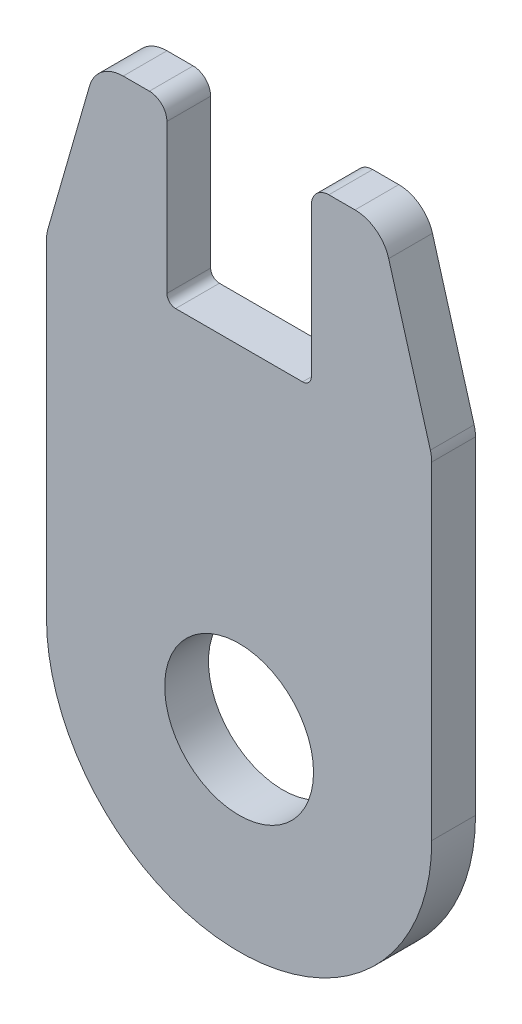
ISO-10303-21;
HEADER;
FILE_DESCRIPTION(('STEP AP214'),'2;1');
FILE_NAME('part.step','',(''),(''),'','','');
FILE_SCHEMA(('AUTOMOTIVE_DESIGN { 1 0 10303 214 1 1 1 1 }'));
ENDSEC;
DATA;
#1=APPLICATION_CONTEXT('core data for automotive mechanical design processes');
#2=APPLICATION_PROTOCOL_DEFINITION('international standard','automotive_design',2000,#1);
#3=PRODUCT_CONTEXT('',#1,'mechanical');
#4=PRODUCT('Part','Part','',(#3));
#5=PRODUCT_RELATED_PRODUCT_CATEGORY('part','',(#4));
#6=PRODUCT_DEFINITION_FORMATION('','',#4);
#7=PRODUCT_DEFINITION_CONTEXT('part definition',#1,'design');
#8=PRODUCT_DEFINITION('design','',#6,#7);
#9=PRODUCT_DEFINITION_SHAPE('','',#8);
#10=(LENGTH_UNIT() NAMED_UNIT(*) SI_UNIT(.MILLI.,.METRE.));
#11=(NAMED_UNIT(*) PLANE_ANGLE_UNIT() SI_UNIT($,.RADIAN.));
#12=(NAMED_UNIT(*) SI_UNIT($,.STERADIAN.) SOLID_ANGLE_UNIT());
#13=UNCERTAINTY_MEASURE_WITH_UNIT(LENGTH_MEASURE(1.E-05),#10,'distance_accuracy_value','');
#14=(GEOMETRIC_REPRESENTATION_CONTEXT(3) GLOBAL_UNCERTAINTY_ASSIGNED_CONTEXT((#13)) GLOBAL_UNIT_ASSIGNED_CONTEXT((#10,
#11,#12)) REPRESENTATION_CONTEXT('',''));
#15=CARTESIAN_POINT('',(0.,0.,0.));
#16=DIRECTION('',(0.,0.,1.));
#17=DIRECTION('',(1.,0.,0.));
#18=AXIS2_PLACEMENT_3D('',#15,#16,#17);
#19=CARTESIAN_POINT('',(0.,0.,1.25));
#20=DIRECTION('',(0.,0.,-1.));
#21=DIRECTION('',(-1.,0.,0.));
#22=AXIS2_PLACEMENT_3D('',#19,#20,#21);
#23=PLANE('',#22);
#24=CARTESIAN_POINT('',(0.,0.,1.25));
#25=DIRECTION('',(0.,0.,1.));
#26=DIRECTION('',(-1.,0.,0.));
#27=AXIS2_PLACEMENT_3D('',#24,#25,#26);
#28=CIRCLE('',#27,11.);
#29=CARTESIAN_POINT('',(-11.,0.,1.25));
#30=VERTEX_POINT('',#29);
#31=CARTESIAN_POINT('',(11.,0.,1.25));
#32=VERTEX_POINT('',#31);
#33=EDGE_CURVE('E224',#30,#32,#28,.T.);
#34=ORIENTED_EDGE('',*,*,#33,.T.);
#35=DIRECTION('',(0.,1.,0.));
#36=VECTOR('',#35,1.);
#37=CARTESIAN_POINT('',(11.,0.,1.25));
#38=LINE('',#37,#36);
#39=CARTESIAN_POINT('',(11.,18.7182073837716,1.25));
#40=VERTEX_POINT('',#39);
#41=EDGE_CURVE('E122',#32,#40,#38,.T.);
#42=ORIENTED_EDGE('',*,*,#41,.T.);
#43=CARTESIAN_POINT('',(9.,18.7182073837716,1.25));
#44=DIRECTION('',(0.,0.,1.));
#45=DIRECTION('',(-1.,0.,0.));
#46=AXIS2_PLACEMENT_3D('',#43,#44,#45);
#47=CIRCLE('',#46,2.);
#48=CARTESIAN_POINT('',(10.9221386078598,19.2708222335312,1.25));
#49=VERTEX_POINT('',#48);
#50=EDGE_CURVE('E269',#40,#49,#47,.T.);
#51=ORIENTED_EDGE('',*,*,#50,.T.);
#52=DIRECTION('',(-0.276307424879841,0.961069303929884,0.));
#53=VECTOR('',#52,1.);
#54=CARTESIAN_POINT('',(8.5411232306941,27.5526148497597,1.25));
#55=LINE('',#54,#53);
#56=CARTESIAN_POINT('',(8.5411232306941,27.5526148497597,1.25));
#57=VERTEX_POINT('',#56);
#58=EDGE_CURVE('E288',#49,#57,#55,.T.);
#59=ORIENTED_EDGE('',*,*,#58,.T.);
#60=CARTESIAN_POINT('',(6.61898462283433,27.,1.25));
#61=DIRECTION('',(0.,0.,1.));
#62=DIRECTION('',(1.,0.,0.));
#63=AXIS2_PLACEMENT_3D('',#60,#61,#62);
#64=CIRCLE('',#63,2.);
#65=CARTESIAN_POINT('',(6.61898462283433,29.,1.25));
#66=VERTEX_POINT('',#65);
#67=EDGE_CURVE('E285',#57,#66,#64,.T.);
#68=ORIENTED_EDGE('',*,*,#67,.T.);
#69=DIRECTION('',(-1.,0.,0.));
#70=VECTOR('',#69,1.);
#71=CARTESIAN_POINT('',(6.61898462283433,29.,1.25));
#72=LINE('',#71,#70);
#73=CARTESIAN_POINT('',(5.125,29.,1.25));
#74=VERTEX_POINT('',#73);
#75=EDGE_CURVE('E287',#66,#74,#72,.T.);
#76=ORIENTED_EDGE('',*,*,#75,.T.);
#77=CARTESIAN_POINT('',(5.125,28.,1.25));
#78=DIRECTION('',(0.,0.,1.));
#79=DIRECTION('',(1.,0.,0.));
#80=AXIS2_PLACEMENT_3D('',#77,#78,#79);
#81=CIRCLE('',#80,1.);
#82=CARTESIAN_POINT('',(4.125,28.,1.25));
#83=VERTEX_POINT('',#82);
#84=EDGE_CURVE('E290',#74,#83,#81,.T.);
#85=ORIENTED_EDGE('',*,*,#84,.T.);
#86=DIRECTION('',(0.,-1.,0.));
#87=VECTOR('',#86,1.);
#88=CARTESIAN_POINT('',(4.125,28.,1.25));
#89=LINE('',#88,#87);
#90=CARTESIAN_POINT('',(4.125,19.5,1.25));
#91=VERTEX_POINT('',#90);
#92=EDGE_CURVE('E296',#83,#91,#89,.T.);
#93=ORIENTED_EDGE('',*,*,#92,.T.);
#94=CARTESIAN_POINT('',(3.625,19.5,1.25));
#95=DIRECTION('',(0.,0.,-1.));
#96=DIRECTION('',(-1.,0.,0.));
#97=AXIS2_PLACEMENT_3D('',#94,#95,#96);
#98=CIRCLE('',#97,0.499999999999999);
#99=CARTESIAN_POINT('',(3.625,19.,1.25));
#100=VERTEX_POINT('',#99);
#101=EDGE_CURVE('E298',#91,#100,#98,.T.);
#102=ORIENTED_EDGE('',*,*,#101,.T.);
#103=DIRECTION('',(-1.,0.,0.));
#104=VECTOR('',#103,1.);
#105=CARTESIAN_POINT('',(3.625,19.,1.25));
#106=LINE('',#105,#104);
#107=CARTESIAN_POINT('',(-3.625,19.,1.25));
#108=VERTEX_POINT('',#107);
#109=EDGE_CURVE('E300',#100,#108,#106,.T.);
#110=ORIENTED_EDGE('',*,*,#109,.T.);
#111=CARTESIAN_POINT('',(-3.625,19.5,1.25));
#112=DIRECTION('',(0.,0.,-1.));
#113=DIRECTION('',(1.,0.,0.));
#114=AXIS2_PLACEMENT_3D('',#111,#112,#113);
#115=CIRCLE('',#114,0.499999999999999);
#116=CARTESIAN_POINT('',(-4.125,19.5,1.25));
#117=VERTEX_POINT('',#116);
#118=EDGE_CURVE('E302',#108,#117,#115,.T.);
#119=ORIENTED_EDGE('',*,*,#118,.T.);
#120=DIRECTION('',(0.,1.,0.));
#121=VECTOR('',#120,1.);
#122=CARTESIAN_POINT('',(-4.125,28.,1.25));
#123=LINE('',#122,#121);
#124=CARTESIAN_POINT('',(-4.125,28.,1.25));
#125=VERTEX_POINT('',#124);
#126=EDGE_CURVE('E304',#117,#125,#123,.T.);
#127=ORIENTED_EDGE('',*,*,#126,.T.);
#128=CARTESIAN_POINT('',(-5.125,28.,1.25));
#129=DIRECTION('',(0.,0.,1.));
#130=DIRECTION('',(-1.,0.,0.));
#131=AXIS2_PLACEMENT_3D('',#128,#129,#130);
#132=CIRCLE('',#131,1.);
#133=CARTESIAN_POINT('',(-5.125,29.,1.25));
#134=VERTEX_POINT('',#133);
#135=EDGE_CURVE('E306',#125,#134,#132,.T.);
#136=ORIENTED_EDGE('',*,*,#135,.T.);
#137=DIRECTION('',(-1.,0.,0.));
#138=VECTOR('',#137,1.);
#139=CARTESIAN_POINT('',(-6.61898462283433,29.,1.25));
#140=LINE('',#139,#138);
#141=CARTESIAN_POINT('',(-6.61898462283433,29.,1.25));
#142=VERTEX_POINT('',#141);
#143=EDGE_CURVE('E308',#134,#142,#140,.T.);
#144=ORIENTED_EDGE('',*,*,#143,.T.);
#145=CARTESIAN_POINT('',(-6.61898462283433,27.,1.25));
#146=DIRECTION('',(0.,0.,1.));
#147=DIRECTION('',(-1.,0.,0.));
#148=AXIS2_PLACEMENT_3D('',#145,#146,#147);
#149=CIRCLE('',#148,2.);
#150=CARTESIAN_POINT('',(-8.5411232306941,27.5526148497597,1.25));
#151=VERTEX_POINT('',#150);
#152=EDGE_CURVE('E171',#142,#151,#149,.T.);
#153=ORIENTED_EDGE('',*,*,#152,.T.);
#154=DIRECTION('',(-0.276307424879841,-0.961069303929884,0.));
#155=VECTOR('',#154,1.);
#156=CARTESIAN_POINT('',(-8.5411232306941,27.5526148497597,1.25));
#157=LINE('',#156,#155);
#158=CARTESIAN_POINT('',(-10.9221386078598,19.2708222335312,1.25));
#159=VERTEX_POINT('',#158);
#160=EDGE_CURVE('E165',#151,#159,#157,.T.);
#161=ORIENTED_EDGE('',*,*,#160,.T.);
#162=CARTESIAN_POINT('',(-9.,18.7182073837716,1.25));
#163=DIRECTION('',(0.,0.,1.));
#164=DIRECTION('',(1.,0.,0.));
#165=AXIS2_PLACEMENT_3D('',#162,#163,#164);
#166=CIRCLE('',#165,2.);
#167=CARTESIAN_POINT('',(-11.,18.7182073837716,1.25));
#168=VERTEX_POINT('',#167);
#169=EDGE_CURVE('E169',#159,#168,#166,.T.);
#170=ORIENTED_EDGE('',*,*,#169,.T.);
#171=DIRECTION('',(0.,-1.,0.));
#172=VECTOR('',#171,1.);
#173=CARTESIAN_POINT('',(-11.,0.,1.25));
#174=LINE('',#173,#172);
#175=EDGE_CURVE('E49',#168,#30,#174,.T.);
#176=ORIENTED_EDGE('',*,*,#175,.T.);
#177=EDGE_LOOP('',(#34,#42,#51,#59,#68,#76,#85,#93,#102,#110,#119,#127,#136,#144,#153,#161,#170,#176));
#178=FACE_BOUND('',#177,.T.);
#179=CARTESIAN_POINT('',(0.,0.,1.25));
#180=DIRECTION('',(0.,0.,1.));
#181=DIRECTION('',(1.,0.,0.));
#182=AXIS2_PLACEMENT_3D('',#179,#180,#181);
#183=CIRCLE('',#182,4.25);
#184=CARTESIAN_POINT('',(4.25,0.,1.25));
#185=VERTEX_POINT('',#184);
#186=EDGE_CURVE('E193',#185,#185,#183,.T.);
#187=ORIENTED_EDGE('',*,*,#186,.F.);
#188=EDGE_LOOP('',(#187));
#189=FACE_BOUND('',#188,.T.);
#190=ADVANCED_FACE('F32',(#178,#189),#23,.F.);
#191=CARTESIAN_POINT('',(0.,0.,-1.25));
#192=DIRECTION('',(0.,0.,-1.));
#193=DIRECTION('',(-1.,0.,0.));
#194=AXIS2_PLACEMENT_3D('',#191,#192,#193);
#195=PLANE('',#194);
#196=CARTESIAN_POINT('',(0.,0.,-1.25));
#197=DIRECTION('',(0.,0.,1.));
#198=DIRECTION('',(-1.,0.,0.));
#199=AXIS2_PLACEMENT_3D('',#196,#197,#198);
#200=CIRCLE('',#199,11.);
#201=CARTESIAN_POINT('',(-11.,0.,-1.25));
#202=VERTEX_POINT('',#201);
#203=CARTESIAN_POINT('',(11.,0.,-1.25));
#204=VERTEX_POINT('',#203);
#205=EDGE_CURVE('E189',#202,#204,#200,.T.);
#206=ORIENTED_EDGE('',*,*,#205,.F.);
#207=DIRECTION('',(0.,-1.,0.));
#208=VECTOR('',#207,1.);
#209=CARTESIAN_POINT('',(-11.,0.,-1.25));
#210=LINE('',#209,#208);
#211=CARTESIAN_POINT('',(-11.,18.7182073837716,-1.25));
#212=VERTEX_POINT('',#211);
#213=EDGE_CURVE('E114',#212,#202,#210,.T.);
#214=ORIENTED_EDGE('',*,*,#213,.F.);
#215=CARTESIAN_POINT('',(-9.,18.7182073837716,-1.25));
#216=DIRECTION('',(0.,0.,1.));
#217=DIRECTION('',(1.,0.,0.));
#218=AXIS2_PLACEMENT_3D('',#215,#216,#217);
#219=CIRCLE('',#218,2.);
#220=CARTESIAN_POINT('',(-10.9221386078598,19.2708222335312,-1.25));
#221=VERTEX_POINT('',#220);
#222=EDGE_CURVE('E108',#221,#212,#219,.T.);
#223=ORIENTED_EDGE('',*,*,#222,.F.);
#224=DIRECTION('',(-0.276307424879841,-0.961069303929884,0.));
#225=VECTOR('',#224,1.);
#226=CARTESIAN_POINT('',(-8.5411232306941,27.5526148497597,-1.25));
#227=LINE('',#226,#225);
#228=CARTESIAN_POINT('',(-8.5411232306941,27.5526148497597,-1.25));
#229=VERTEX_POINT('',#228);
#230=EDGE_CURVE('E179',#229,#221,#227,.T.);
#231=ORIENTED_EDGE('',*,*,#230,.F.);
#232=CARTESIAN_POINT('',(-6.61898462283433,27.,-1.25));
#233=DIRECTION('',(0.,0.,1.));
#234=DIRECTION('',(-1.,0.,0.));
#235=AXIS2_PLACEMENT_3D('',#232,#233,#234);
#236=CIRCLE('',#235,2.);
#237=CARTESIAN_POINT('',(-6.61898462283433,29.,-1.25));
#238=VERTEX_POINT('',#237);
#239=EDGE_CURVE('E219',#238,#229,#236,.T.);
#240=ORIENTED_EDGE('',*,*,#239,.F.);
#241=DIRECTION('',(-1.,0.,0.));
#242=VECTOR('',#241,1.);
#243=CARTESIAN_POINT('',(-6.61898462283433,29.,-1.25));
#244=LINE('',#243,#242);
#245=CARTESIAN_POINT('',(-5.125,29.,-1.25));
#246=VERTEX_POINT('',#245);
#247=EDGE_CURVE('E217',#246,#238,#244,.T.);
#248=ORIENTED_EDGE('',*,*,#247,.F.);
#249=CARTESIAN_POINT('',(-5.125,28.,-1.25));
#250=DIRECTION('',(0.,0.,1.));
#251=DIRECTION('',(-1.,0.,0.));
#252=AXIS2_PLACEMENT_3D('',#249,#250,#251);
#253=CIRCLE('',#252,1.);
#254=CARTESIAN_POINT('',(-4.125,28.,-1.25));
#255=VERTEX_POINT('',#254);
#256=EDGE_CURVE('E215',#255,#246,#253,.T.);
#257=ORIENTED_EDGE('',*,*,#256,.F.);
#258=DIRECTION('',(0.,1.,0.));
#259=VECTOR('',#258,1.);
#260=CARTESIAN_POINT('',(-4.125,28.,-1.25));
#261=LINE('',#260,#259);
#262=CARTESIAN_POINT('',(-4.125,19.5,-1.25));
#263=VERTEX_POINT('',#262);
#264=EDGE_CURVE('E213',#263,#255,#261,.T.);
#265=ORIENTED_EDGE('',*,*,#264,.F.);
#266=CARTESIAN_POINT('',(-3.625,19.5,-1.25));
#267=DIRECTION('',(0.,0.,-1.));
#268=DIRECTION('',(1.,0.,0.));
#269=AXIS2_PLACEMENT_3D('',#266,#267,#268);
#270=CIRCLE('',#269,0.499999999999999);
#271=CARTESIAN_POINT('',(-3.625,19.,-1.25));
#272=VERTEX_POINT('',#271);
#273=EDGE_CURVE('E211',#272,#263,#270,.T.);
#274=ORIENTED_EDGE('',*,*,#273,.F.);
#275=DIRECTION('',(-1.,0.,0.));
#276=VECTOR('',#275,1.);
#277=CARTESIAN_POINT('',(3.625,19.,-1.25));
#278=LINE('',#277,#276);
#279=CARTESIAN_POINT('',(3.625,19.,-1.25));
#280=VERTEX_POINT('',#279);
#281=EDGE_CURVE('E209',#280,#272,#278,.T.);
#282=ORIENTED_EDGE('',*,*,#281,.F.);
#283=CARTESIAN_POINT('',(3.625,19.5,-1.25));
#284=DIRECTION('',(0.,0.,-1.));
#285=DIRECTION('',(-1.,0.,0.));
#286=AXIS2_PLACEMENT_3D('',#283,#284,#285);
#287=CIRCLE('',#286,0.499999999999999);
#288=CARTESIAN_POINT('',(4.125,19.5,-1.25));
#289=VERTEX_POINT('',#288);
#290=EDGE_CURVE('E207',#289,#280,#287,.T.);
#291=ORIENTED_EDGE('',*,*,#290,.F.);
#292=DIRECTION('',(0.,-1.,0.));
#293=VECTOR('',#292,1.);
#294=CARTESIAN_POINT('',(4.125,28.,-1.25));
#295=LINE('',#294,#293);
#296=CARTESIAN_POINT('',(4.125,28.,-1.25));
#297=VERTEX_POINT('',#296);
#298=EDGE_CURVE('E205',#297,#289,#295,.T.);
#299=ORIENTED_EDGE('',*,*,#298,.F.);
#300=CARTESIAN_POINT('',(5.125,28.,-1.25));
#301=DIRECTION('',(0.,0.,1.));
#302=DIRECTION('',(1.,0.,0.));
#303=AXIS2_PLACEMENT_3D('',#300,#301,#302);
#304=CIRCLE('',#303,1.);
#305=CARTESIAN_POINT('',(5.125,29.,-1.25));
#306=VERTEX_POINT('',#305);
#307=EDGE_CURVE('E203',#306,#297,#304,.T.);
#308=ORIENTED_EDGE('',*,*,#307,.F.);
#309=DIRECTION('',(-1.,0.,0.));
#310=VECTOR('',#309,1.);
#311=CARTESIAN_POINT('',(6.61898462283433,29.,-1.25));
#312=LINE('',#311,#310);
#313=CARTESIAN_POINT('',(6.61898462283433,29.,-1.25));
#314=VERTEX_POINT('',#313);
#315=EDGE_CURVE('E201',#314,#306,#312,.T.);
#316=ORIENTED_EDGE('',*,*,#315,.F.);
#317=CARTESIAN_POINT('',(6.61898462283433,27.,-1.25));
#318=DIRECTION('',(0.,0.,1.));
#319=DIRECTION('',(1.,0.,0.));
#320=AXIS2_PLACEMENT_3D('',#317,#318,#319);
#321=CIRCLE('',#320,2.);
#322=CARTESIAN_POINT('',(8.5411232306941,27.5526148497597,-1.25));
#323=VERTEX_POINT('',#322);
#324=EDGE_CURVE('E199',#323,#314,#321,.T.);
#325=ORIENTED_EDGE('',*,*,#324,.F.);
#326=DIRECTION('',(-0.276307424879841,0.961069303929884,0.));
#327=VECTOR('',#326,1.);
#328=CARTESIAN_POINT('',(8.5411232306941,27.5526148497597,-1.25));
#329=LINE('',#328,#327);
#330=CARTESIAN_POINT('',(10.9221386078598,19.2708222335312,-1.25));
#331=VERTEX_POINT('',#330);
#332=EDGE_CURVE('E197',#331,#323,#329,.T.);
#333=ORIENTED_EDGE('',*,*,#332,.F.);
#334=CARTESIAN_POINT('',(9.,18.7182073837716,-1.25));
#335=DIRECTION('',(0.,0.,1.));
#336=DIRECTION('',(-1.,0.,0.));
#337=AXIS2_PLACEMENT_3D('',#334,#335,#336);
#338=CIRCLE('',#337,2.);
#339=CARTESIAN_POINT('',(11.,18.7182073837716,-1.25));
#340=VERTEX_POINT('',#339);
#341=EDGE_CURVE('E195',#340,#331,#338,.T.);
#342=ORIENTED_EDGE('',*,*,#341,.F.);
#343=DIRECTION('',(0.,1.,0.));
#344=VECTOR('',#343,1.);
#345=CARTESIAN_POINT('',(11.,0.,-1.25));
#346=LINE('',#345,#344);
#347=EDGE_CURVE('E192',#204,#340,#346,.T.);
#348=ORIENTED_EDGE('',*,*,#347,.F.);
#349=EDGE_LOOP('',(#206,#214,#223,#231,#240,#248,#257,#265,#274,#282,#291,#299,#308,#316,#325,
#333,#342,#348));
#350=FACE_BOUND('',#349,.T.);
#351=CARTESIAN_POINT('',(0.,0.,-1.25));
#352=DIRECTION('',(0.,0.,1.));
#353=DIRECTION('',(1.,0.,0.));
#354=AXIS2_PLACEMENT_3D('',#351,#352,#353);
#355=CIRCLE('',#354,4.25);
#356=CARTESIAN_POINT('',(4.25,0.,-1.25));
#357=VERTEX_POINT('',#356);
#358=EDGE_CURVE('E533',#357,#357,#355,.T.);
#359=ORIENTED_EDGE('',*,*,#358,.T.);
#360=EDGE_LOOP('',(#359));
#361=FACE_BOUND('',#360,.T.);
#362=ADVANCED_FACE('F273',(#350,#361),#195,.T.);
#363=CARTESIAN_POINT('',(0.,0.,1.25));
#364=DIRECTION('',(0.,0.,-1.));
#365=DIRECTION('',(-1.,0.,0.));
#366=AXIS2_PLACEMENT_3D('',#363,#364,#365);
#367=CYLINDRICAL_SURFACE('',#366,11.);
#368=ORIENTED_EDGE('',*,*,#205,.T.);
#369=DIRECTION('',(0.,0.,-1.));
#370=VECTOR('',#369,1.);
#371=CARTESIAN_POINT('',(11.,0.,1.25));
#372=LINE('',#371,#370);
#373=EDGE_CURVE('E11',#32,#204,#372,.T.);
#374=ORIENTED_EDGE('',*,*,#373,.F.);
#375=ORIENTED_EDGE('',*,*,#33,.F.);
#376=DIRECTION('',(0.,0.,-1.));
#377=VECTOR('',#376,1.);
#378=CARTESIAN_POINT('',(-11.,0.,1.25));
#379=LINE('',#378,#377);
#380=EDGE_CURVE('E185',#30,#202,#379,.T.);
#381=ORIENTED_EDGE('',*,*,#380,.T.);
#382=EDGE_LOOP('',(#368,#374,#375,#381));
#383=FACE_BOUND('',#382,.T.);
#384=ADVANCED_FACE('F34',(#383),#367,.T.);
#385=CARTESIAN_POINT('',(11.,0.,1.25));
#386=DIRECTION('',(-1.,0.,0.));
#387=DIRECTION('',(0.,-1.,0.));
#388=AXIS2_PLACEMENT_3D('',#385,#386,#387);
#389=PLANE('',#388);
#390=ORIENTED_EDGE('',*,*,#347,.T.);
#391=DIRECTION('',(0.,0.,-1.));
#392=VECTOR('',#391,1.);
#393=CARTESIAN_POINT('',(11.,18.7182073837716,1.25));
#394=LINE('',#393,#392);
#395=EDGE_CURVE('E41',#40,#340,#394,.T.);
#396=ORIENTED_EDGE('',*,*,#395,.F.);
#397=ORIENTED_EDGE('',*,*,#41,.F.);
#398=ORIENTED_EDGE('',*,*,#373,.T.);
#399=EDGE_LOOP('',(#390,#396,#397,#398));
#400=FACE_BOUND('',#399,.T.);
#401=ADVANCED_FACE('F342',(#400),#389,.F.);
#402=CARTESIAN_POINT('',(9.,18.7182073837716,1.25));
#403=DIRECTION('',(0.,0.,-1.));
#404=DIRECTION('',(-1.,0.,0.));
#405=AXIS2_PLACEMENT_3D('',#402,#403,#404);
#406=CYLINDRICAL_SURFACE('',#405,2.);
#407=ORIENTED_EDGE('',*,*,#341,.T.);
#408=DIRECTION('',(0.,0.,-1.));
#409=VECTOR('',#408,1.);
#410=CARTESIAN_POINT('',(10.9221386078598,19.2708222335312,1.25));
#411=LINE('',#410,#409);
#412=EDGE_CURVE('E261',#49,#331,#411,.T.);
#413=ORIENTED_EDGE('',*,*,#412,.F.);
#414=ORIENTED_EDGE('',*,*,#50,.F.);
#415=ORIENTED_EDGE('',*,*,#395,.T.);
#416=EDGE_LOOP('',(#407,#413,#414,#415));
#417=FACE_BOUND('',#416,.T.);
#418=ADVANCED_FACE('F267',(#417),#406,.T.);
#419=CARTESIAN_POINT('',(8.5411232306941,27.5526148497597,1.25));
#420=DIRECTION('',(-0.961069303929884,-0.276307424879841,0.));
#421=DIRECTION('',(0.276307424879841,-0.961069303929884,0.));
#422=AXIS2_PLACEMENT_3D('',#419,#420,#421);
#423=PLANE('',#422);
#424=ORIENTED_EDGE('',*,*,#332,.T.);
#425=DIRECTION('',(0.,0.,-1.));
#426=VECTOR('',#425,1.);
#427=CARTESIAN_POINT('',(8.5411232306941,27.5526148497597,1.25));
#428=LINE('',#427,#426);
#429=EDGE_CURVE('E258',#57,#323,#428,.T.);
#430=ORIENTED_EDGE('',*,*,#429,.F.);
#431=ORIENTED_EDGE('',*,*,#58,.F.);
#432=ORIENTED_EDGE('',*,*,#412,.T.);
#433=EDGE_LOOP('',(#424,#430,#431,#432));
#434=FACE_BOUND('',#433,.T.);
#435=ADVANCED_FACE('F279',(#434),#423,.F.);
#436=CARTESIAN_POINT('',(6.61898462283433,27.,1.25));
#437=DIRECTION('',(0.,0.,-1.));
#438=DIRECTION('',(-1.,0.,0.));
#439=AXIS2_PLACEMENT_3D('',#436,#437,#438);
#440=CYLINDRICAL_SURFACE('',#439,2.);
#441=ORIENTED_EDGE('',*,*,#324,.T.);
#442=DIRECTION('',(0.,0.,-1.));
#443=VECTOR('',#442,1.);
#444=CARTESIAN_POINT('',(6.61898462283433,29.,1.25));
#445=LINE('',#444,#443);
#446=EDGE_CURVE('E255',#66,#314,#445,.T.);
#447=ORIENTED_EDGE('',*,*,#446,.F.);
#448=ORIENTED_EDGE('',*,*,#67,.F.);
#449=ORIENTED_EDGE('',*,*,#429,.T.);
#450=EDGE_LOOP('',(#441,#447,#448,#449));
#451=FACE_BOUND('',#450,.T.);
#452=ADVANCED_FACE('F283',(#451),#440,.T.);
#453=CARTESIAN_POINT('',(6.61898462283433,29.,1.25));
#454=DIRECTION('',(0.,-1.,0.));
#455=DIRECTION('',(0.,0.,-1.));
#456=AXIS2_PLACEMENT_3D('',#453,#454,#455);
#457=PLANE('',#456);
#458=ORIENTED_EDGE('',*,*,#315,.T.);
#459=DIRECTION('',(0.,0.,-1.));
#460=VECTOR('',#459,1.);
#461=CARTESIAN_POINT('',(5.125,29.,1.25));
#462=LINE('',#461,#460);
#463=EDGE_CURVE('E252',#74,#306,#462,.T.);
#464=ORIENTED_EDGE('',*,*,#463,.F.);
#465=ORIENTED_EDGE('',*,*,#75,.F.);
#466=ORIENTED_EDGE('',*,*,#446,.T.);
#467=EDGE_LOOP('',(#458,#464,#465,#466));
#468=FACE_BOUND('',#467,.T.);
#469=ADVANCED_FACE('F355',(#468),#457,.F.);
#470=CARTESIAN_POINT('',(5.125,28.,1.25));
#471=DIRECTION('',(0.,0.,-1.));
#472=DIRECTION('',(-1.,0.,0.));
#473=AXIS2_PLACEMENT_3D('',#470,#471,#472);
#474=CYLINDRICAL_SURFACE('',#473,1.);
#475=ORIENTED_EDGE('',*,*,#307,.T.);
#476=DIRECTION('',(0.,0.,-1.));
#477=VECTOR('',#476,1.);
#478=CARTESIAN_POINT('',(4.125,28.,1.25));
#479=LINE('',#478,#477);
#480=EDGE_CURVE('E249',#83,#297,#479,.T.);
#481=ORIENTED_EDGE('',*,*,#480,.F.);
#482=ORIENTED_EDGE('',*,*,#84,.F.);
#483=ORIENTED_EDGE('',*,*,#463,.T.);
#484=EDGE_LOOP('',(#475,#481,#482,#483));
#485=FACE_BOUND('',#484,.T.);
#486=ADVANCED_FACE('F358',(#485),#474,.T.);
#487=CARTESIAN_POINT('',(4.125,28.,1.25));
#488=DIRECTION('',(1.,0.,0.));
#489=DIRECTION('',(0.,0.,-1.));
#490=AXIS2_PLACEMENT_3D('',#487,#488,#489);
#491=PLANE('',#490);
#492=ORIENTED_EDGE('',*,*,#298,.T.);
#493=DIRECTION('',(0.,0.,-1.));
#494=VECTOR('',#493,1.);
#495=CARTESIAN_POINT('',(4.125,19.5,1.25));
#496=LINE('',#495,#494);
#497=EDGE_CURVE('E246',#91,#289,#496,.T.);
#498=ORIENTED_EDGE('',*,*,#497,.F.);
#499=ORIENTED_EDGE('',*,*,#92,.F.);
#500=ORIENTED_EDGE('',*,*,#480,.T.);
#501=EDGE_LOOP('',(#492,#498,#499,#500));
#502=FACE_BOUND('',#501,.T.);
#503=ADVANCED_FACE('F362',(#502),#491,.F.);
#504=CARTESIAN_POINT('',(3.625,19.5,1.25));
#505=DIRECTION('',(0.,0.,-1.));
#506=DIRECTION('',(-1.,0.,0.));
#507=AXIS2_PLACEMENT_3D('',#504,#505,#506);
#508=CYLINDRICAL_SURFACE('',#507,0.499999999999999);
#509=ORIENTED_EDGE('',*,*,#290,.T.);
#510=DIRECTION('',(0.,0.,-1.));
#511=VECTOR('',#510,1.);
#512=CARTESIAN_POINT('',(3.625,19.,1.25));
#513=LINE('',#512,#511);
#514=EDGE_CURVE('E243',#100,#280,#513,.T.);
#515=ORIENTED_EDGE('',*,*,#514,.F.);
#516=ORIENTED_EDGE('',*,*,#101,.F.);
#517=ORIENTED_EDGE('',*,*,#497,.T.);
#518=EDGE_LOOP('',(#509,#515,#516,#517));
#519=FACE_BOUND('',#518,.T.);
#520=ADVANCED_FACE('F366',(#519),#508,.F.);
#521=CARTESIAN_POINT('',(3.625,19.,1.25));
#522=DIRECTION('',(0.,-1.,0.));
#523=DIRECTION('',(0.,0.,-1.));
#524=AXIS2_PLACEMENT_3D('',#521,#522,#523);
#525=PLANE('',#524);
#526=ORIENTED_EDGE('',*,*,#281,.T.);
#527=DIRECTION('',(0.,0.,-1.));
#528=VECTOR('',#527,1.);
#529=CARTESIAN_POINT('',(-3.625,19.,1.25));
#530=LINE('',#529,#528);
#531=EDGE_CURVE('E240',#108,#272,#530,.T.);
#532=ORIENTED_EDGE('',*,*,#531,.F.);
#533=ORIENTED_EDGE('',*,*,#109,.F.);
#534=ORIENTED_EDGE('',*,*,#514,.T.);
#535=EDGE_LOOP('',(#526,#532,#533,#534));
#536=FACE_BOUND('',#535,.T.);
#537=ADVANCED_FACE('F370',(#536),#525,.F.);
#538=CARTESIAN_POINT('',(-3.625,19.5,1.25));
#539=DIRECTION('',(0.,0.,-1.));
#540=DIRECTION('',(-1.,0.,0.));
#541=AXIS2_PLACEMENT_3D('',#538,#539,#540);
#542=CYLINDRICAL_SURFACE('',#541,0.499999999999999);
#543=ORIENTED_EDGE('',*,*,#273,.T.);
#544=DIRECTION('',(0.,0.,-1.));
#545=VECTOR('',#544,1.);
#546=CARTESIAN_POINT('',(-4.125,19.5,1.25));
#547=LINE('',#546,#545);
#548=EDGE_CURVE('E237',#117,#263,#547,.T.);
#549=ORIENTED_EDGE('',*,*,#548,.F.);
#550=ORIENTED_EDGE('',*,*,#118,.F.);
#551=ORIENTED_EDGE('',*,*,#531,.T.);
#552=EDGE_LOOP('',(#543,#549,#550,#551));
#553=FACE_BOUND('',#552,.T.);
#554=ADVANCED_FACE('F374',(#553),#542,.F.);
#555=CARTESIAN_POINT('',(-4.125,28.,1.25));
#556=DIRECTION('',(-1.,0.,0.));
#557=DIRECTION('',(0.,0.,1.));
#558=AXIS2_PLACEMENT_3D('',#555,#556,#557);
#559=PLANE('',#558);
#560=ORIENTED_EDGE('',*,*,#264,.T.);
#561=DIRECTION('',(0.,0.,-1.));
#562=VECTOR('',#561,1.);
#563=CARTESIAN_POINT('',(-4.125,28.,1.25));
#564=LINE('',#563,#562);
#565=EDGE_CURVE('E234',#125,#255,#564,.T.);
#566=ORIENTED_EDGE('',*,*,#565,.F.);
#567=ORIENTED_EDGE('',*,*,#126,.F.);
#568=ORIENTED_EDGE('',*,*,#548,.T.);
#569=EDGE_LOOP('',(#560,#566,#567,#568));
#570=FACE_BOUND('',#569,.T.);
#571=ADVANCED_FACE('F378',(#570),#559,.F.);
#572=CARTESIAN_POINT('',(-5.125,28.,1.25));
#573=DIRECTION('',(0.,0.,-1.));
#574=DIRECTION('',(-1.,0.,0.));
#575=AXIS2_PLACEMENT_3D('',#572,#573,#574);
#576=CYLINDRICAL_SURFACE('',#575,1.);
#577=ORIENTED_EDGE('',*,*,#256,.T.);
#578=DIRECTION('',(0.,0.,-1.));
#579=VECTOR('',#578,1.);
#580=CARTESIAN_POINT('',(-5.125,29.,1.25));
#581=LINE('',#580,#579);
#582=EDGE_CURVE('E231',#134,#246,#581,.T.);
#583=ORIENTED_EDGE('',*,*,#582,.F.);
#584=ORIENTED_EDGE('',*,*,#135,.F.);
#585=ORIENTED_EDGE('',*,*,#565,.T.);
#586=EDGE_LOOP('',(#577,#583,#584,#585));
#587=FACE_BOUND('',#586,.T.);
#588=ADVANCED_FACE('F382',(#587),#576,.T.);
#589=CARTESIAN_POINT('',(-6.61898462283433,29.,1.25));
#590=DIRECTION('',(0.,-1.,0.));
#591=DIRECTION('',(0.,0.,-1.));
#592=AXIS2_PLACEMENT_3D('',#589,#590,#591);
#593=PLANE('',#592);
#594=ORIENTED_EDGE('',*,*,#247,.T.);
#595=DIRECTION('',(0.,0.,-1.));
#596=VECTOR('',#595,1.);
#597=CARTESIAN_POINT('',(-6.61898462283433,29.,1.25));
#598=LINE('',#597,#596);
#599=EDGE_CURVE('E228',#142,#238,#598,.T.);
#600=ORIENTED_EDGE('',*,*,#599,.F.);
#601=ORIENTED_EDGE('',*,*,#143,.F.);
#602=ORIENTED_EDGE('',*,*,#582,.T.);
#603=EDGE_LOOP('',(#594,#600,#601,#602));
#604=FACE_BOUND('',#603,.T.);
#605=ADVANCED_FACE('F314',(#604),#593,.F.);
#606=CARTESIAN_POINT('',(-6.61898462283433,27.,1.25));
#607=DIRECTION('',(0.,0.,-1.));
#608=DIRECTION('',(-1.,0.,0.));
#609=AXIS2_PLACEMENT_3D('',#606,#607,#608);
#610=CYLINDRICAL_SURFACE('',#609,2.);
#611=ORIENTED_EDGE('',*,*,#239,.T.);
#612=DIRECTION('',(0.,0.,-1.));
#613=VECTOR('',#612,1.);
#614=CARTESIAN_POINT('',(-8.5411232306941,27.5526148497597,1.25));
#615=LINE('',#614,#613);
#616=EDGE_CURVE('E180',#151,#229,#615,.T.);
#617=ORIENTED_EDGE('',*,*,#616,.F.);
#618=ORIENTED_EDGE('',*,*,#152,.F.);
#619=ORIENTED_EDGE('',*,*,#599,.T.);
#620=EDGE_LOOP('',(#611,#617,#618,#619));
#621=FACE_BOUND('',#620,.T.);
#622=ADVANCED_FACE('F318',(#621),#610,.T.);
#623=CARTESIAN_POINT('',(-8.5411232306941,27.5526148497597,1.25));
#624=DIRECTION('',(0.961069303929884,-0.276307424879841,0.));
#625=DIRECTION('',(0.276307424879841,0.961069303929884,0.));
#626=AXIS2_PLACEMENT_3D('',#623,#624,#625);
#627=PLANE('',#626);
#628=ORIENTED_EDGE('',*,*,#230,.T.);
#629=DIRECTION('',(0.,0.,-1.));
#630=VECTOR('',#629,1.);
#631=CARTESIAN_POINT('',(-10.9221386078598,19.2708222335312,1.25));
#632=LINE('',#631,#630);
#633=EDGE_CURVE('E176',#159,#221,#632,.T.);
#634=ORIENTED_EDGE('',*,*,#633,.F.);
#635=ORIENTED_EDGE('',*,*,#160,.F.);
#636=ORIENTED_EDGE('',*,*,#616,.T.);
#637=EDGE_LOOP('',(#628,#634,#635,#636));
#638=FACE_BOUND('',#637,.T.);
#639=ADVANCED_FACE('F177',(#638),#627,.F.);
#640=CARTESIAN_POINT('',(-9.,18.7182073837716,1.25));
#641=DIRECTION('',(0.,0.,-1.));
#642=DIRECTION('',(-1.,0.,0.));
#643=AXIS2_PLACEMENT_3D('',#640,#641,#642);
#644=CYLINDRICAL_SURFACE('',#643,2.);
#645=ORIENTED_EDGE('',*,*,#222,.T.);
#646=DIRECTION('',(0.,0.,-1.));
#647=VECTOR('',#646,1.);
#648=CARTESIAN_POINT('',(-11.,18.7182073837716,1.25));
#649=LINE('',#648,#647);
#650=EDGE_CURVE('E181',#168,#212,#649,.T.);
#651=ORIENTED_EDGE('',*,*,#650,.F.);
#652=ORIENTED_EDGE('',*,*,#169,.F.);
#653=ORIENTED_EDGE('',*,*,#633,.T.);
#654=EDGE_LOOP('',(#645,#651,#652,#653));
#655=FACE_BOUND('',#654,.T.);
#656=ADVANCED_FACE('F183',(#655),#644,.T.);
#657=CARTESIAN_POINT('',(-11.,0.,1.25));
#658=DIRECTION('',(1.,0.,0.));
#659=DIRECTION('',(0.,1.,0.));
#660=AXIS2_PLACEMENT_3D('',#657,#658,#659);
#661=PLANE('',#660);
#662=ORIENTED_EDGE('',*,*,#213,.T.);
#663=ORIENTED_EDGE('',*,*,#380,.F.);
#664=ORIENTED_EDGE('',*,*,#175,.F.);
#665=ORIENTED_EDGE('',*,*,#650,.T.);
#666=EDGE_LOOP('',(#662,#663,#664,#665));
#667=FACE_BOUND('',#666,.T.);
#668=ADVANCED_FACE('F322',(#667),#661,.F.);
#669=CARTESIAN_POINT('',(0.,0.,1.25));
#670=DIRECTION('',(0.,0.,-1.));
#671=DIRECTION('',(-1.,0.,0.));
#672=AXIS2_PLACEMENT_3D('',#669,#670,#671);
#673=CYLINDRICAL_SURFACE('',#672,4.25);
#674=ORIENTED_EDGE('',*,*,#186,.T.);
#675=EDGE_LOOP('',(#674));
#676=FACE_BOUND('',#675,.T.);
#677=ORIENTED_EDGE('',*,*,#358,.F.);
#678=EDGE_LOOP('',(#677));
#679=FACE_BOUND('',#678,.T.);
#680=ADVANCED_FACE('F324',(#676,#679),#673,.F.);
#681=CLOSED_SHELL('',(#190,#362,#384,#401,#418,#435,#452,#469,#486,#503,#520,#537,#554,#571,
#588,#605,#622,#639,#656,#668,#680));
#682=MANIFOLD_SOLID_BREP('B2',#681);
#683=ADVANCED_BREP_SHAPE_REPRESENTATION('',(#18,#682),#14);
#684=SHAPE_DEFINITION_REPRESENTATION(#9,#683);
ENDSEC;
END-ISO-10303-21;
